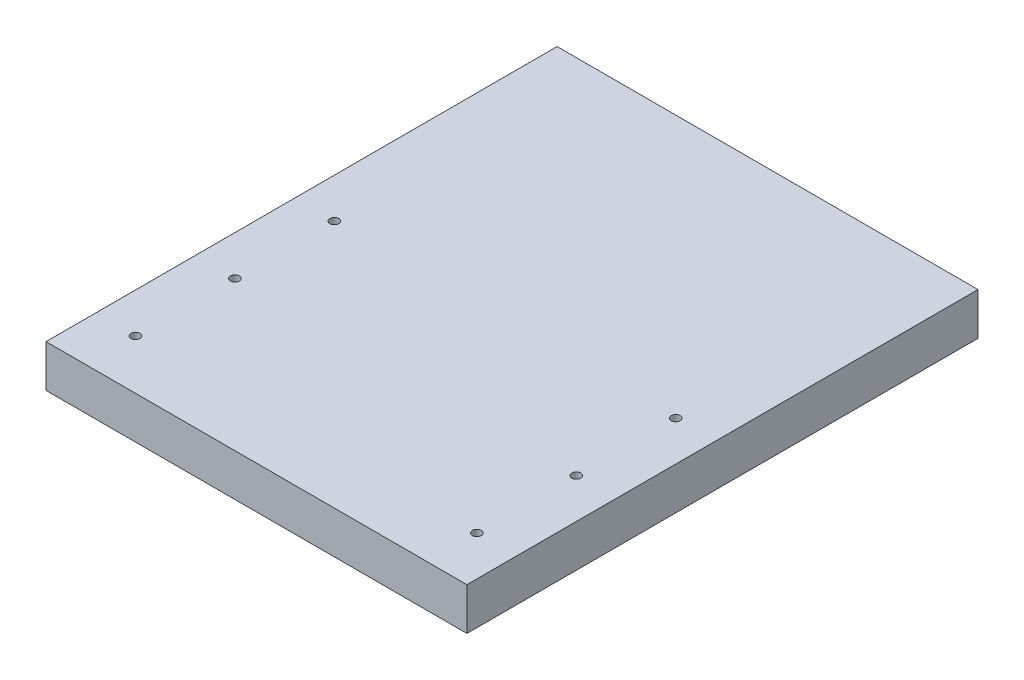
ISO-10303-21;
HEADER;
FILE_DESCRIPTION(('STEP AP214'),'2;1');
FILE_NAME('part.step','',(''),(''),'','','');
FILE_SCHEMA(('AUTOMOTIVE_DESIGN { 1 0 10303 214 1 1 1 1 }'));
ENDSEC;
DATA;
#1=APPLICATION_CONTEXT('core data for automotive mechanical design processes');
#2=APPLICATION_PROTOCOL_DEFINITION('international standard','automotive_design',2000,#1);
#3=PRODUCT_CONTEXT('',#1,'mechanical');
#4=PRODUCT('Part','Part','',(#3));
#5=PRODUCT_RELATED_PRODUCT_CATEGORY('part','',(#4));
#6=PRODUCT_DEFINITION_FORMATION('','',#4);
#7=PRODUCT_DEFINITION_CONTEXT('part definition',#1,'design');
#8=PRODUCT_DEFINITION('design','',#6,#7);
#9=PRODUCT_DEFINITION_SHAPE('','',#8);
#10=(LENGTH_UNIT() NAMED_UNIT(*) SI_UNIT(.MILLI.,.METRE.));
#11=(NAMED_UNIT(*) PLANE_ANGLE_UNIT() SI_UNIT($,.RADIAN.));
#12=(NAMED_UNIT(*) SI_UNIT($,.STERADIAN.) SOLID_ANGLE_UNIT());
#13=UNCERTAINTY_MEASURE_WITH_UNIT(LENGTH_MEASURE(1.E-05),#10,'distance_accuracy_value','');
#14=(GEOMETRIC_REPRESENTATION_CONTEXT(3) GLOBAL_UNCERTAINTY_ASSIGNED_CONTEXT((#13)) GLOBAL_UNIT_ASSIGNED_CONTEXT((#10,
#11,#12)) REPRESENTATION_CONTEXT('',''));
#15=CARTESIAN_POINT('',(0.,0.,0.));
#16=DIRECTION('',(0.,0.,1.));
#17=DIRECTION('',(1.,0.,0.));
#18=AXIS2_PLACEMENT_3D('',#15,#16,#17);
#19=CARTESIAN_POINT('',(0.,12.75,0.));
#20=DIRECTION('',(1.,0.,0.));
#21=DIRECTION('',(0.,0.,-1.));
#22=AXIS2_PLACEMENT_3D('',#19,#20,#21);
#23=PLANE('',#22);
#24=DIRECTION('',(0.,0.,1.));
#25=VECTOR('',#24,1.);
#26=CARTESIAN_POINT('',(0.,0.,0.));
#27=LINE('',#26,#25);
#28=CARTESIAN_POINT('',(0.,0.,-154.21));
#29=VERTEX_POINT('',#28);
#30=CARTESIAN_POINT('',(0.,0.,0.));
#31=VERTEX_POINT('',#30);
#32=EDGE_CURVE('E96',#29,#31,#27,.T.);
#33=ORIENTED_EDGE('',*,*,#32,.T.);
#34=DIRECTION('',(0.,-1.,0.));
#35=VECTOR('',#34,1.);
#36=CARTESIAN_POINT('',(0.,12.75,0.));
#37=LINE('',#36,#35);
#38=CARTESIAN_POINT('',(0.,12.75,0.));
#39=VERTEX_POINT('',#38);
#40=EDGE_CURVE('E11',#39,#31,#37,.T.);
#41=ORIENTED_EDGE('',*,*,#40,.F.);
#42=DIRECTION('',(0.,0.,1.));
#43=VECTOR('',#42,1.);
#44=CARTESIAN_POINT('',(0.,12.75,0.));
#45=LINE('',#44,#43);
#46=CARTESIAN_POINT('',(0.,12.75,-154.21));
#47=VERTEX_POINT('',#46);
#48=EDGE_CURVE('E84',#47,#39,#45,.T.);
#49=ORIENTED_EDGE('',*,*,#48,.F.);
#50=DIRECTION('',(0.,-1.,0.));
#51=VECTOR('',#50,1.);
#52=CARTESIAN_POINT('',(0.,12.75,-154.21));
#53=LINE('',#52,#51);
#54=EDGE_CURVE('E92',#47,#29,#53,.T.);
#55=ORIENTED_EDGE('',*,*,#54,.T.);
#56=EDGE_LOOP('',(#33,#41,#49,#55));
#57=FACE_BOUND('',#56,.T.);
#58=ADVANCED_FACE('F33',(#57),#23,.F.);
#59=CARTESIAN_POINT('',(0.,12.75,0.));
#60=DIRECTION('',(0.,0.,-1.));
#61=DIRECTION('',(-1.,0.,0.));
#62=AXIS2_PLACEMENT_3D('',#59,#60,#61);
#63=PLANE('',#62);
#64=DIRECTION('',(1.,0.,0.));
#65=VECTOR('',#64,1.);
#66=CARTESIAN_POINT('',(0.,0.,0.));
#67=LINE('',#66,#65);
#68=CARTESIAN_POINT('',(127.,0.,0.));
#69=VERTEX_POINT('',#68);
#70=EDGE_CURVE('E88',#31,#69,#67,.T.);
#71=ORIENTED_EDGE('',*,*,#70,.T.);
#72=DIRECTION('',(0.,-1.,0.));
#73=VECTOR('',#72,1.);
#74=CARTESIAN_POINT('',(127.,12.75,0.));
#75=LINE('',#74,#73);
#76=CARTESIAN_POINT('',(127.,12.75,0.));
#77=VERTEX_POINT('',#76);
#78=EDGE_CURVE('E41',#77,#69,#75,.T.);
#79=ORIENTED_EDGE('',*,*,#78,.F.);
#80=DIRECTION('',(1.,0.,0.));
#81=VECTOR('',#80,1.);
#82=CARTESIAN_POINT('',(0.,12.75,0.));
#83=LINE('',#82,#81);
#84=EDGE_CURVE('E79',#39,#77,#83,.T.);
#85=ORIENTED_EDGE('',*,*,#84,.F.);
#86=ORIENTED_EDGE('',*,*,#40,.T.);
#87=EDGE_LOOP('',(#71,#79,#85,#86));
#88=FACE_BOUND('',#87,.T.);
#89=ADVANCED_FACE('F87',(#88),#63,.F.);
#90=CARTESIAN_POINT('',(127.,12.75,0.));
#91=DIRECTION('',(-1.,0.,0.));
#92=DIRECTION('',(0.,0.,1.));
#93=AXIS2_PLACEMENT_3D('',#90,#91,#92);
#94=PLANE('',#93);
#95=DIRECTION('',(0.,0.,-1.));
#96=VECTOR('',#95,1.);
#97=CARTESIAN_POINT('',(127.,0.,0.));
#98=LINE('',#97,#96);
#99=CARTESIAN_POINT('',(127.,0.,-154.21));
#100=VERTEX_POINT('',#99);
#101=EDGE_CURVE('E66',#69,#100,#98,.T.);
#102=ORIENTED_EDGE('',*,*,#101,.T.);
#103=DIRECTION('',(0.,-1.,0.));
#104=VECTOR('',#103,1.);
#105=CARTESIAN_POINT('',(127.,12.75,-154.21));
#106=LINE('',#105,#104);
#107=CARTESIAN_POINT('',(127.,12.75,-154.21));
#108=VERTEX_POINT('',#107);
#109=EDGE_CURVE('E89',#108,#100,#106,.T.);
#110=ORIENTED_EDGE('',*,*,#109,.F.);
#111=DIRECTION('',(0.,0.,-1.));
#112=VECTOR('',#111,1.);
#113=CARTESIAN_POINT('',(127.,12.75,0.));
#114=LINE('',#113,#112);
#115=EDGE_CURVE('E82',#77,#108,#114,.T.);
#116=ORIENTED_EDGE('',*,*,#115,.F.);
#117=ORIENTED_EDGE('',*,*,#78,.T.);
#118=EDGE_LOOP('',(#102,#110,#116,#117));
#119=FACE_BOUND('',#118,.T.);
#120=ADVANCED_FACE('F90',(#119),#94,.F.);
#121=CARTESIAN_POINT('',(0.,12.75,-154.21));
#122=DIRECTION('',(0.,0.,1.));
#123=DIRECTION('',(1.,0.,0.));
#124=AXIS2_PLACEMENT_3D('',#121,#122,#123);
#125=PLANE('',#124);
#126=DIRECTION('',(-1.,0.,0.));
#127=VECTOR('',#126,1.);
#128=CARTESIAN_POINT('',(0.,0.,-154.21));
#129=LINE('',#128,#127);
#130=EDGE_CURVE('E72',#100,#29,#129,.T.);
#131=ORIENTED_EDGE('',*,*,#130,.T.);
#132=ORIENTED_EDGE('',*,*,#54,.F.);
#133=DIRECTION('',(-1.,0.,0.));
#134=VECTOR('',#133,1.);
#135=CARTESIAN_POINT('',(0.,12.75,-154.21));
#136=LINE('',#135,#134);
#137=EDGE_CURVE('E49',#108,#47,#136,.T.);
#138=ORIENTED_EDGE('',*,*,#137,.F.);
#139=ORIENTED_EDGE('',*,*,#109,.T.);
#140=EDGE_LOOP('',(#131,#132,#138,#139));
#141=FACE_BOUND('',#140,.T.);
#142=ADVANCED_FACE('F104',(#141),#125,.F.);
#143=CARTESIAN_POINT('',(0.,12.75,0.));
#144=DIRECTION('',(0.,-1.,0.));
#145=DIRECTION('',(0.,0.,-1.));
#146=AXIS2_PLACEMENT_3D('',#143,#144,#145);
#147=PLANE('',#146);
#148=CARTESIAN_POINT('',(115.,12.75,-75.));
#149=DIRECTION('',(0.,1.,0.));
#150=DIRECTION('',(0.,0.,1.));
#151=AXIS2_PLACEMENT_3D('',#148,#149,#150);
#152=CIRCLE('',#151,1.35000000000001);
#153=CARTESIAN_POINT('',(115.,12.75,-73.65));
#154=VERTEX_POINT('',#153);
#155=EDGE_CURVE('E140',#154,#154,#152,.T.);
#156=ORIENTED_EDGE('',*,*,#155,.F.);
#157=EDGE_LOOP('',(#156));
#158=FACE_BOUND('',#157,.T.);
#159=CARTESIAN_POINT('',(12.,12.75,-75.));
#160=DIRECTION('',(0.,1.,0.));
#161=DIRECTION('',(0.,0.,1.));
#162=AXIS2_PLACEMENT_3D('',#159,#160,#161);
#163=CIRCLE('',#162,1.35);
#164=CARTESIAN_POINT('',(12.,12.75,-73.65));
#165=VERTEX_POINT('',#164);
#166=EDGE_CURVE('E134',#165,#165,#163,.T.);
#167=ORIENTED_EDGE('',*,*,#166,.F.);
#168=EDGE_LOOP('',(#167));
#169=FACE_BOUND('',#168,.T.);
#170=CARTESIAN_POINT('',(12.,12.75,-45.));
#171=DIRECTION('',(0.,1.,0.));
#172=DIRECTION('',(0.,0.,1.));
#173=AXIS2_PLACEMENT_3D('',#170,#171,#172);
#174=CIRCLE('',#173,1.35);
#175=CARTESIAN_POINT('',(12.,12.75,-43.65));
#176=VERTEX_POINT('',#175);
#177=EDGE_CURVE('E128',#176,#176,#174,.T.);
#178=ORIENTED_EDGE('',*,*,#177,.F.);
#179=EDGE_LOOP('',(#178));
#180=FACE_BOUND('',#179,.T.);
#181=CARTESIAN_POINT('',(115.,12.75,-45.));
#182=DIRECTION('',(0.,1.,0.));
#183=DIRECTION('',(0.,0.,1.));
#184=AXIS2_PLACEMENT_3D('',#181,#182,#183);
#185=CIRCLE('',#184,1.35000000000001);
#186=CARTESIAN_POINT('',(115.,12.75,-43.65));
#187=VERTEX_POINT('',#186);
#188=EDGE_CURVE('E122',#187,#187,#185,.T.);
#189=ORIENTED_EDGE('',*,*,#188,.F.);
#190=EDGE_LOOP('',(#189));
#191=FACE_BOUND('',#190,.T.);
#192=CARTESIAN_POINT('',(115.,12.75,-15.));
#193=DIRECTION('',(0.,1.,0.));
#194=DIRECTION('',(0.,0.,1.));
#195=AXIS2_PLACEMENT_3D('',#192,#193,#194);
#196=CIRCLE('',#195,1.35000000000001);
#197=CARTESIAN_POINT('',(115.,12.75,-13.65));
#198=VERTEX_POINT('',#197);
#199=EDGE_CURVE('E116',#198,#198,#196,.T.);
#200=ORIENTED_EDGE('',*,*,#199,.F.);
#201=EDGE_LOOP('',(#200));
#202=FACE_BOUND('',#201,.T.);
#203=CARTESIAN_POINT('',(12.,12.75,-15.));
#204=DIRECTION('',(0.,1.,0.));
#205=DIRECTION('',(0.,0.,1.));
#206=AXIS2_PLACEMENT_3D('',#203,#204,#205);
#207=CIRCLE('',#206,1.35);
#208=CARTESIAN_POINT('',(12.,12.75,-13.65));
#209=VERTEX_POINT('',#208);
#210=EDGE_CURVE('E110',#209,#209,#207,.T.);
#211=ORIENTED_EDGE('',*,*,#210,.F.);
#212=EDGE_LOOP('',(#211));
#213=FACE_BOUND('',#212,.T.);
#214=ORIENTED_EDGE('',*,*,#48,.T.);
#215=ORIENTED_EDGE('',*,*,#84,.T.);
#216=ORIENTED_EDGE('',*,*,#115,.T.);
#217=ORIENTED_EDGE('',*,*,#137,.T.);
#218=EDGE_LOOP('',(#214,#215,#216,#217));
#219=FACE_BOUND('',#218,.T.);
#220=ADVANCED_FACE('F80',(#158,#169,#180,#191,#202,#213,#219),#147,.F.);
#221=CARTESIAN_POINT('',(0.,0.,0.));
#222=DIRECTION('',(0.,-1.,0.));
#223=DIRECTION('',(0.,0.,-1.));
#224=AXIS2_PLACEMENT_3D('',#221,#222,#223);
#225=PLANE('',#224);
#226=CARTESIAN_POINT('',(115.,0.,-75.));
#227=DIRECTION('',(0.,1.,0.));
#228=DIRECTION('',(0.,0.,1.));
#229=AXIS2_PLACEMENT_3D('',#226,#227,#228);
#230=CIRCLE('',#229,1.35000000000001);
#231=CARTESIAN_POINT('',(115.,0.,-73.65));
#232=VERTEX_POINT('',#231);
#233=EDGE_CURVE('E137',#232,#232,#230,.T.);
#234=ORIENTED_EDGE('',*,*,#233,.T.);
#235=EDGE_LOOP('',(#234));
#236=FACE_BOUND('',#235,.T.);
#237=CARTESIAN_POINT('',(12.,0.,-75.));
#238=DIRECTION('',(0.,1.,0.));
#239=DIRECTION('',(0.,0.,1.));
#240=AXIS2_PLACEMENT_3D('',#237,#238,#239);
#241=CIRCLE('',#240,1.35);
#242=CARTESIAN_POINT('',(12.,0.,-73.65));
#243=VERTEX_POINT('',#242);
#244=EDGE_CURVE('E131',#243,#243,#241,.T.);
#245=ORIENTED_EDGE('',*,*,#244,.T.);
#246=EDGE_LOOP('',(#245));
#247=FACE_BOUND('',#246,.T.);
#248=CARTESIAN_POINT('',(12.,0.,-45.));
#249=DIRECTION('',(0.,1.,0.));
#250=DIRECTION('',(0.,0.,1.));
#251=AXIS2_PLACEMENT_3D('',#248,#249,#250);
#252=CIRCLE('',#251,1.35);
#253=CARTESIAN_POINT('',(12.,0.,-43.65));
#254=VERTEX_POINT('',#253);
#255=EDGE_CURVE('E125',#254,#254,#252,.T.);
#256=ORIENTED_EDGE('',*,*,#255,.T.);
#257=EDGE_LOOP('',(#256));
#258=FACE_BOUND('',#257,.T.);
#259=CARTESIAN_POINT('',(115.,0.,-45.));
#260=DIRECTION('',(0.,1.,0.));
#261=DIRECTION('',(0.,0.,1.));
#262=AXIS2_PLACEMENT_3D('',#259,#260,#261);
#263=CIRCLE('',#262,1.35000000000001);
#264=CARTESIAN_POINT('',(115.,0.,-43.65));
#265=VERTEX_POINT('',#264);
#266=EDGE_CURVE('E119',#265,#265,#263,.T.);
#267=ORIENTED_EDGE('',*,*,#266,.T.);
#268=EDGE_LOOP('',(#267));
#269=FACE_BOUND('',#268,.T.);
#270=CARTESIAN_POINT('',(115.,0.,-15.));
#271=DIRECTION('',(0.,1.,0.));
#272=DIRECTION('',(0.,0.,1.));
#273=AXIS2_PLACEMENT_3D('',#270,#271,#272);
#274=CIRCLE('',#273,1.35000000000001);
#275=CARTESIAN_POINT('',(115.,0.,-13.65));
#276=VERTEX_POINT('',#275);
#277=EDGE_CURVE('E113',#276,#276,#274,.T.);
#278=ORIENTED_EDGE('',*,*,#277,.T.);
#279=EDGE_LOOP('',(#278));
#280=FACE_BOUND('',#279,.T.);
#281=CARTESIAN_POINT('',(12.,0.,-15.));
#282=DIRECTION('',(0.,1.,0.));
#283=DIRECTION('',(0.,0.,1.));
#284=AXIS2_PLACEMENT_3D('',#281,#282,#283);
#285=CIRCLE('',#284,1.35);
#286=CARTESIAN_POINT('',(12.,0.,-13.65));
#287=VERTEX_POINT('',#286);
#288=EDGE_CURVE('E99',#287,#287,#285,.T.);
#289=ORIENTED_EDGE('',*,*,#288,.T.);
#290=EDGE_LOOP('',(#289));
#291=FACE_BOUND('',#290,.T.);
#292=ORIENTED_EDGE('',*,*,#32,.F.);
#293=ORIENTED_EDGE('',*,*,#130,.F.);
#294=ORIENTED_EDGE('',*,*,#101,.F.);
#295=ORIENTED_EDGE('',*,*,#70,.F.);
#296=EDGE_LOOP('',(#292,#293,#294,#295));
#297=FACE_BOUND('',#296,.T.);
#298=ADVANCED_FACE('F107',(#236,#247,#258,#269,#280,#291,#297),#225,.T.);
#299=CARTESIAN_POINT('',(12.,0.,-15.));
#300=DIRECTION('',(0.,1.,0.));
#301=DIRECTION('',(0.,0.,1.));
#302=AXIS2_PLACEMENT_3D('',#299,#300,#301);
#303=CYLINDRICAL_SURFACE('',#302,1.35);
#304=ORIENTED_EDGE('',*,*,#288,.F.);
#305=EDGE_LOOP('',(#304));
#306=FACE_BOUND('',#305,.T.);
#307=ORIENTED_EDGE('',*,*,#210,.T.);
#308=EDGE_LOOP('',(#307));
#309=FACE_BOUND('',#308,.T.);
#310=ADVANCED_FACE('F168',(#306,#309),#303,.F.);
#311=CARTESIAN_POINT('',(115.,0.,-15.));
#312=DIRECTION('',(0.,1.,0.));
#313=DIRECTION('',(0.,0.,1.));
#314=AXIS2_PLACEMENT_3D('',#311,#312,#313);
#315=CYLINDRICAL_SURFACE('',#314,1.35000000000001);
#316=ORIENTED_EDGE('',*,*,#277,.F.);
#317=EDGE_LOOP('',(#316));
#318=FACE_BOUND('',#317,.T.);
#319=ORIENTED_EDGE('',*,*,#199,.T.);
#320=EDGE_LOOP('',(#319));
#321=FACE_BOUND('',#320,.T.);
#322=ADVANCED_FACE('F170',(#318,#321),#315,.F.);
#323=CARTESIAN_POINT('',(115.,0.,-45.));
#324=DIRECTION('',(0.,1.,0.));
#325=DIRECTION('',(0.,0.,1.));
#326=AXIS2_PLACEMENT_3D('',#323,#324,#325);
#327=CYLINDRICAL_SURFACE('',#326,1.35000000000001);
#328=ORIENTED_EDGE('',*,*,#266,.F.);
#329=EDGE_LOOP('',(#328));
#330=FACE_BOUND('',#329,.T.);
#331=ORIENTED_EDGE('',*,*,#188,.T.);
#332=EDGE_LOOP('',(#331));
#333=FACE_BOUND('',#332,.T.);
#334=ADVANCED_FACE('F177',(#330,#333),#327,.F.);
#335=CARTESIAN_POINT('',(12.,0.,-45.));
#336=DIRECTION('',(0.,1.,0.));
#337=DIRECTION('',(0.,0.,1.));
#338=AXIS2_PLACEMENT_3D('',#335,#336,#337);
#339=CYLINDRICAL_SURFACE('',#338,1.35);
#340=ORIENTED_EDGE('',*,*,#255,.F.);
#341=EDGE_LOOP('',(#340));
#342=FACE_BOUND('',#341,.T.);
#343=ORIENTED_EDGE('',*,*,#177,.T.);
#344=EDGE_LOOP('',(#343));
#345=FACE_BOUND('',#344,.T.);
#346=ADVANCED_FACE('F223',(#342,#345),#339,.F.);
#347=CARTESIAN_POINT('',(12.,0.,-75.));
#348=DIRECTION('',(0.,1.,0.));
#349=DIRECTION('',(0.,0.,1.));
#350=AXIS2_PLACEMENT_3D('',#347,#348,#349);
#351=CYLINDRICAL_SURFACE('',#350,1.35);
#352=ORIENTED_EDGE('',*,*,#244,.F.);
#353=EDGE_LOOP('',(#352));
#354=FACE_BOUND('',#353,.T.);
#355=ORIENTED_EDGE('',*,*,#166,.T.);
#356=EDGE_LOOP('',(#355));
#357=FACE_BOUND('',#356,.T.);
#358=ADVANCED_FACE('F151',(#354,#357),#351,.F.);
#359=CARTESIAN_POINT('',(115.,0.,-75.));
#360=DIRECTION('',(0.,1.,0.));
#361=DIRECTION('',(0.,0.,1.));
#362=AXIS2_PLACEMENT_3D('',#359,#360,#361);
#363=CYLINDRICAL_SURFACE('',#362,1.35000000000001);
#364=ORIENTED_EDGE('',*,*,#233,.F.);
#365=EDGE_LOOP('',(#364));
#366=FACE_BOUND('',#365,.T.);
#367=ORIENTED_EDGE('',*,*,#155,.T.);
#368=EDGE_LOOP('',(#367));
#369=FACE_BOUND('',#368,.T.);
#370=ADVANCED_FACE('F148',(#366,#369),#363,.F.);
#371=CLOSED_SHELL('',(#58,#89,#120,#142,#220,#298,#310,#322,#334,#346,#358,#370));
#372=MANIFOLD_SOLID_BREP('B2',#371);
#373=ADVANCED_BREP_SHAPE_REPRESENTATION('',(#18,#372),#14);
#374=SHAPE_DEFINITION_REPRESENTATION(#9,#373);
ENDSEC;
END-ISO-10303-21;
